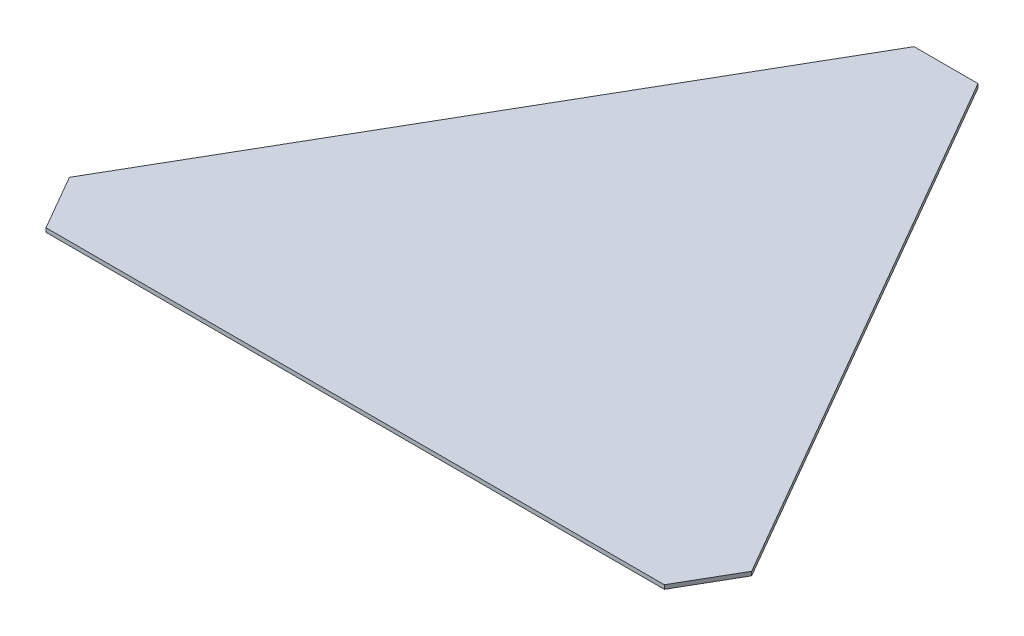
ISO-10303-21;
HEADER;
FILE_DESCRIPTION(('STEP AP214'),'2;1');
FILE_NAME('part.step','',(''),(''),'','','');
FILE_SCHEMA(('AUTOMOTIVE_DESIGN { 1 0 10303 214 1 1 1 1 }'));
ENDSEC;
DATA;
#1=APPLICATION_CONTEXT('core data for automotive mechanical design processes');
#2=APPLICATION_PROTOCOL_DEFINITION('international standard','automotive_design',2000,#1);
#3=PRODUCT_CONTEXT('',#1,'mechanical');
#4=PRODUCT('Part','Part','',(#3));
#5=PRODUCT_RELATED_PRODUCT_CATEGORY('part','',(#4));
#6=PRODUCT_DEFINITION_FORMATION('','',#4);
#7=PRODUCT_DEFINITION_CONTEXT('part definition',#1,'design');
#8=PRODUCT_DEFINITION('design','',#6,#7);
#9=PRODUCT_DEFINITION_SHAPE('','',#8);
#10=(LENGTH_UNIT() NAMED_UNIT(*) SI_UNIT(.MILLI.,.METRE.));
#11=(NAMED_UNIT(*) PLANE_ANGLE_UNIT() SI_UNIT($,.RADIAN.));
#12=(NAMED_UNIT(*) SI_UNIT($,.STERADIAN.) SOLID_ANGLE_UNIT());
#13=UNCERTAINTY_MEASURE_WITH_UNIT(LENGTH_MEASURE(1.E-05),#10,'distance_accuracy_value','');
#14=(GEOMETRIC_REPRESENTATION_CONTEXT(3) GLOBAL_UNCERTAINTY_ASSIGNED_CONTEXT((#13)) GLOBAL_UNIT_ASSIGNED_CONTEXT((#10,
#11,#12)) REPRESENTATION_CONTEXT('',''));
#15=CARTESIAN_POINT('',(0.,0.,0.));
#16=DIRECTION('',(0.,0.,1.));
#17=DIRECTION('',(1.,0.,0.));
#18=AXIS2_PLACEMENT_3D('',#15,#16,#17);
#19=CARTESIAN_POINT('',(427.031939778685,5.,200.358983848625));
#20=DIRECTION('',(-0.86602540378444,0.,0.499999999999998));
#21=DIRECTION('',(0.499999999999998,0.,0.86602540378444));
#22=AXIS2_PLACEMENT_3D('',#19,#20,#21);
#23=PLANE('',#22);
#24=DIRECTION('',(-0.499999999999998,0.,-0.86602540378444));
#25=VECTOR('',#24,1.);
#26=CARTESIAN_POINT('',(427.031939778685,0.,200.358983848625));
#27=LINE('',#26,#25);
#28=CARTESIAN_POINT('',(427.031939778685,0.,200.358983848625));
#29=VERTEX_POINT('',#28);
#30=CARTESIAN_POINT('',(40.,0.,-470.));
#31=VERTEX_POINT('',#30);
#32=EDGE_CURVE('E117',#29,#31,#27,.T.);
#33=ORIENTED_EDGE('',*,*,#32,.T.);
#34=DIRECTION('',(0.,-1.,0.));
#35=VECTOR('',#34,1.);
#36=CARTESIAN_POINT('',(40.,5.,-470.));
#37=LINE('',#36,#35);
#38=CARTESIAN_POINT('',(40.,5.,-470.));
#39=VERTEX_POINT('',#38);
#40=EDGE_CURVE('E11',#39,#31,#37,.T.);
#41=ORIENTED_EDGE('',*,*,#40,.F.);
#42=DIRECTION('',(-0.499999999999998,0.,-0.86602540378444));
#43=VECTOR('',#42,1.);
#44=CARTESIAN_POINT('',(427.031939778685,5.,200.358983848625));
#45=LINE('',#44,#43);
#46=CARTESIAN_POINT('',(427.031939778685,5.,200.358983848625));
#47=VERTEX_POINT('',#46);
#48=EDGE_CURVE('E127',#47,#39,#45,.T.);
#49=ORIENTED_EDGE('',*,*,#48,.F.);
#50=DIRECTION('',(0.,-1.,0.));
#51=VECTOR('',#50,1.);
#52=CARTESIAN_POINT('',(427.031939778685,5.,200.358983848625));
#53=LINE('',#52,#51);
#54=EDGE_CURVE('E113',#47,#29,#53,.T.);
#55=ORIENTED_EDGE('',*,*,#54,.T.);
#56=EDGE_LOOP('',(#33,#41,#49,#55));
#57=FACE_BOUND('',#56,.T.);
#58=ADVANCED_FACE('F33',(#57),#23,.F.);
#59=CARTESIAN_POINT('',(-40.,5.,-470.));
#60=DIRECTION('',(0.,0.,1.));
#61=DIRECTION('',(1.,0.,0.));
#62=AXIS2_PLACEMENT_3D('',#59,#60,#61);
#63=PLANE('',#62);
#64=DIRECTION('',(-1.,0.,0.));
#65=VECTOR('',#64,1.);
#66=CARTESIAN_POINT('',(-40.,0.,-470.));
#67=LINE('',#66,#65);
#68=CARTESIAN_POINT('',(-40.,0.,-470.));
#69=VERTEX_POINT('',#68);
#70=EDGE_CURVE('E120',#31,#69,#67,.T.);
#71=ORIENTED_EDGE('',*,*,#70,.T.);
#72=DIRECTION('',(0.,-1.,0.));
#73=VECTOR('',#72,1.);
#74=CARTESIAN_POINT('',(-40.,5.,-470.));
#75=LINE('',#74,#73);
#76=CARTESIAN_POINT('',(-40.,5.,-470.));
#77=VERTEX_POINT('',#76);
#78=EDGE_CURVE('E41',#77,#69,#75,.T.);
#79=ORIENTED_EDGE('',*,*,#78,.F.);
#80=DIRECTION('',(-1.,0.,0.));
#81=VECTOR('',#80,1.);
#82=CARTESIAN_POINT('',(-40.,5.,-470.));
#83=LINE('',#82,#81);
#84=EDGE_CURVE('E86',#39,#77,#83,.T.);
#85=ORIENTED_EDGE('',*,*,#84,.F.);
#86=ORIENTED_EDGE('',*,*,#40,.T.);
#87=EDGE_LOOP('',(#71,#79,#85,#86));
#88=FACE_BOUND('',#87,.T.);
#89=ADVANCED_FACE('F151',(#88),#63,.F.);
#90=CARTESIAN_POINT('',(-40.,5.,-470.));
#91=DIRECTION('',(0.866025403784436,0.,0.500000000000004));
#92=DIRECTION('',(0.500000000000004,0.,-0.866025403784436));
#93=AXIS2_PLACEMENT_3D('',#90,#91,#92);
#94=PLANE('',#93);
#95=DIRECTION('',(-0.500000000000004,0.,0.866025403784436));
#96=VECTOR('',#95,1.);
#97=CARTESIAN_POINT('',(-40.,0.,-470.));
#98=LINE('',#97,#96);
#99=CARTESIAN_POINT('',(-427.031939778688,0.,200.358983848619));
#100=VERTEX_POINT('',#99);
#101=EDGE_CURVE('E122',#69,#100,#98,.T.);
#102=ORIENTED_EDGE('',*,*,#101,.T.);
#103=DIRECTION('',(0.,-1.,0.));
#104=VECTOR('',#103,1.);
#105=CARTESIAN_POINT('',(-427.031939778688,5.,200.358983848619));
#106=LINE('',#105,#104);
#107=CARTESIAN_POINT('',(-427.031939778688,5.,200.358983848619));
#108=VERTEX_POINT('',#107);
#109=EDGE_CURVE('E108',#108,#100,#106,.T.);
#110=ORIENTED_EDGE('',*,*,#109,.F.);
#111=DIRECTION('',(-0.500000000000004,0.,0.866025403784436));
#112=VECTOR('',#111,1.);
#113=CARTESIAN_POINT('',(-40.,5.,-470.));
#114=LINE('',#113,#112);
#115=EDGE_CURVE('E99',#77,#108,#114,.T.);
#116=ORIENTED_EDGE('',*,*,#115,.F.);
#117=ORIENTED_EDGE('',*,*,#78,.T.);
#118=EDGE_LOOP('',(#102,#110,#116,#117));
#119=FACE_BOUND('',#118,.T.);
#120=ADVANCED_FACE('F133',(#119),#94,.F.);
#121=CARTESIAN_POINT('',(-387.031939778689,5.,269.641016151374));
#122=DIRECTION('',(0.866025403784443,0.,-0.499999999999992));
#123=DIRECTION('',(-0.499999999999992,0.,-0.866025403784443));
#124=AXIS2_PLACEMENT_3D('',#121,#122,#123);
#125=PLANE('',#124);
#126=DIRECTION('',(0.499999999999992,0.,0.866025403784443));
#127=VECTOR('',#126,1.);
#128=CARTESIAN_POINT('',(-387.031939778689,0.,269.641016151374));
#129=LINE('',#128,#127);
#130=CARTESIAN_POINT('',(-387.031939778689,0.,269.641016151374));
#131=VERTEX_POINT('',#130);
#132=EDGE_CURVE('E107',#100,#131,#129,.T.);
#133=ORIENTED_EDGE('',*,*,#132,.T.);
#134=DIRECTION('',(0.,-1.,0.));
#135=VECTOR('',#134,1.);
#136=CARTESIAN_POINT('',(-387.031939778689,5.,269.641016151374));
#137=LINE('',#136,#135);
#138=CARTESIAN_POINT('',(-387.031939778689,5.,269.641016151374));
#139=VERTEX_POINT('',#138);
#140=EDGE_CURVE('E104',#139,#131,#137,.T.);
#141=ORIENTED_EDGE('',*,*,#140,.F.);
#142=DIRECTION('',(0.499999999999992,0.,0.866025403784443));
#143=VECTOR('',#142,1.);
#144=CARTESIAN_POINT('',(-387.031939778689,5.,269.641016151374));
#145=LINE('',#144,#143);
#146=EDGE_CURVE('E93',#108,#139,#145,.T.);
#147=ORIENTED_EDGE('',*,*,#146,.F.);
#148=ORIENTED_EDGE('',*,*,#109,.T.);
#149=EDGE_LOOP('',(#133,#141,#147,#148));
#150=FACE_BOUND('',#149,.T.);
#151=ADVANCED_FACE('F105',(#150),#125,.F.);
#152=CARTESIAN_POINT('',(-387.031939778689,5.,269.641016151374));
#153=DIRECTION('',(0.,0.,-1.));
#154=DIRECTION('',(-1.,0.,0.));
#155=AXIS2_PLACEMENT_3D('',#152,#153,#154);
#156=PLANE('',#155);
#157=DIRECTION('',(1.,0.,0.));
#158=VECTOR('',#157,1.);
#159=CARTESIAN_POINT('',(-387.031939778689,0.,269.641016151374));
#160=LINE('',#159,#158);
#161=CARTESIAN_POINT('',(387.031939778685,0.,269.641016151379));
#162=VERTEX_POINT('',#161);
#163=EDGE_CURVE('E72',#131,#162,#160,.T.);
#164=ORIENTED_EDGE('',*,*,#163,.T.);
#165=DIRECTION('',(0.,-1.,0.));
#166=VECTOR('',#165,1.);
#167=CARTESIAN_POINT('',(387.031939778685,5.,269.641016151379));
#168=LINE('',#167,#166);
#169=CARTESIAN_POINT('',(387.031939778685,5.,269.641016151379));
#170=VERTEX_POINT('',#169);
#171=EDGE_CURVE('E109',#170,#162,#168,.T.);
#172=ORIENTED_EDGE('',*,*,#171,.F.);
#173=DIRECTION('',(1.,0.,0.));
#174=VECTOR('',#173,1.);
#175=CARTESIAN_POINT('',(-387.031939778689,5.,269.641016151374));
#176=LINE('',#175,#174);
#177=EDGE_CURVE('E97',#139,#170,#176,.T.);
#178=ORIENTED_EDGE('',*,*,#177,.F.);
#179=ORIENTED_EDGE('',*,*,#140,.T.);
#180=EDGE_LOOP('',(#164,#172,#178,#179));
#181=FACE_BOUND('',#180,.T.);
#182=ADVANCED_FACE('F111',(#181),#156,.F.);
#183=CARTESIAN_POINT('',(427.031939778685,5.,200.358983848625));
#184=DIRECTION('',(-0.866025403784436,0.,-0.500000000000004));
#185=DIRECTION('',(-0.500000000000004,0.,0.866025403784436));
#186=AXIS2_PLACEMENT_3D('',#183,#184,#185);
#187=PLANE('',#186);
#188=DIRECTION('',(0.500000000000004,0.,-0.866025403784436));
#189=VECTOR('',#188,1.);
#190=CARTESIAN_POINT('',(427.031939778685,0.,200.358983848625));
#191=LINE('',#190,#189);
#192=EDGE_CURVE('E78',#162,#29,#191,.T.);
#193=ORIENTED_EDGE('',*,*,#192,.T.);
#194=ORIENTED_EDGE('',*,*,#54,.F.);
#195=DIRECTION('',(0.500000000000004,0.,-0.866025403784436));
#196=VECTOR('',#195,1.);
#197=CARTESIAN_POINT('',(427.031939778685,5.,200.358983848625));
#198=LINE('',#197,#196);
#199=EDGE_CURVE('E49',#170,#47,#198,.T.);
#200=ORIENTED_EDGE('',*,*,#199,.F.);
#201=ORIENTED_EDGE('',*,*,#171,.T.);
#202=EDGE_LOOP('',(#193,#194,#200,#201));
#203=FACE_BOUND('',#202,.T.);
#204=ADVANCED_FACE('F140',(#203),#187,.F.);
#205=CARTESIAN_POINT('',(0.,5.,0.));
#206=DIRECTION('',(0.,-1.,0.));
#207=DIRECTION('',(0.,0.,-1.));
#208=AXIS2_PLACEMENT_3D('',#205,#206,#207);
#209=PLANE('',#208);
#210=ORIENTED_EDGE('',*,*,#48,.T.);
#211=ORIENTED_EDGE('',*,*,#84,.T.);
#212=ORIENTED_EDGE('',*,*,#115,.T.);
#213=ORIENTED_EDGE('',*,*,#146,.T.);
#214=ORIENTED_EDGE('',*,*,#177,.T.);
#215=ORIENTED_EDGE('',*,*,#199,.T.);
#216=EDGE_LOOP('',(#210,#211,#212,#213,#214,#215));
#217=FACE_BOUND('',#216,.T.);
#218=ADVANCED_FACE('F95',(#217),#209,.F.);
#219=CARTESIAN_POINT('',(0.,0.,0.));
#220=DIRECTION('',(0.,-1.,0.));
#221=DIRECTION('',(0.,0.,-1.));
#222=AXIS2_PLACEMENT_3D('',#219,#220,#221);
#223=PLANE('',#222);
#224=ORIENTED_EDGE('',*,*,#32,.F.);
#225=ORIENTED_EDGE('',*,*,#192,.F.);
#226=ORIENTED_EDGE('',*,*,#163,.F.);
#227=ORIENTED_EDGE('',*,*,#132,.F.);
#228=ORIENTED_EDGE('',*,*,#101,.F.);
#229=ORIENTED_EDGE('',*,*,#70,.F.);
#230=EDGE_LOOP('',(#224,#225,#226,#227,#228,#229));
#231=FACE_BOUND('',#230,.T.);
#232=ADVANCED_FACE('F136',(#231),#223,.T.);
#233=CLOSED_SHELL('',(#58,#89,#120,#151,#182,#204,#218,#232));
#234=MANIFOLD_SOLID_BREP('B2',#233);
#235=ADVANCED_BREP_SHAPE_REPRESENTATION('',(#18,#234),#14);
#236=SHAPE_DEFINITION_REPRESENTATION(#9,#235);
ENDSEC;
END-ISO-10303-21;
